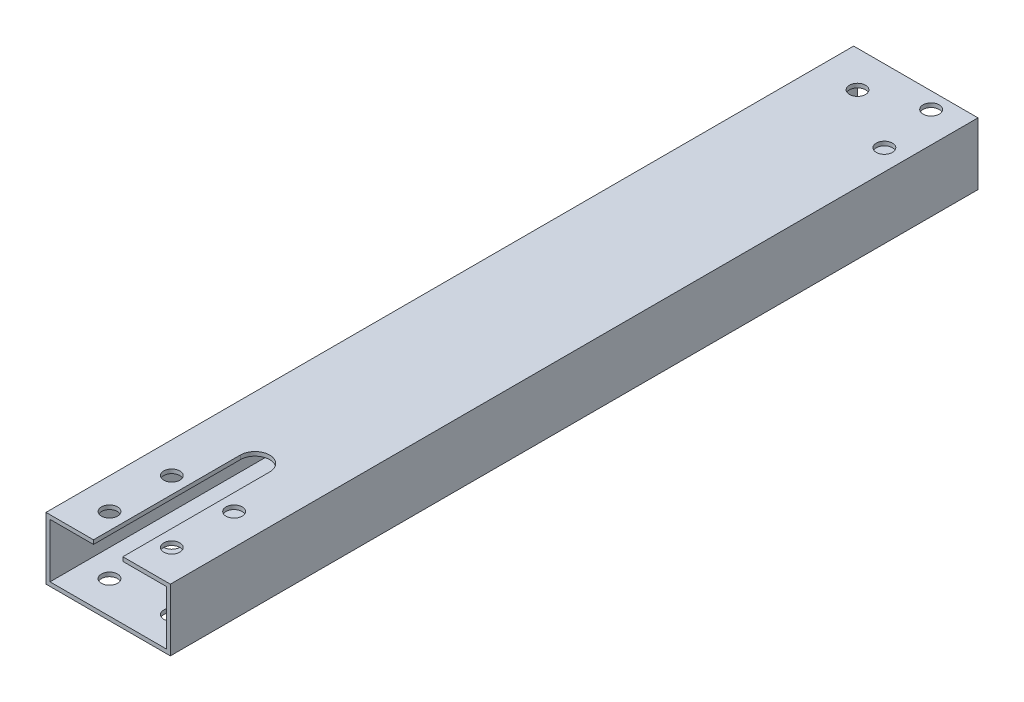
ISO-10303-21;
HEADER;
FILE_DESCRIPTION(('STEP AP214'),'2;1');
FILE_NAME('part.step','',(''),(''),'','','');
FILE_SCHEMA(('AUTOMOTIVE_DESIGN { 1 0 10303 214 1 1 1 1 }'));
ENDSEC;
DATA;
#1=APPLICATION_CONTEXT('core data for automotive mechanical design processes');
#2=APPLICATION_PROTOCOL_DEFINITION('international standard','automotive_design',2000,#1);
#3=PRODUCT_CONTEXT('',#1,'mechanical');
#4=PRODUCT('Part','Part','',(#3));
#5=PRODUCT_RELATED_PRODUCT_CATEGORY('part','',(#4));
#6=PRODUCT_DEFINITION_FORMATION('','',#4);
#7=PRODUCT_DEFINITION_CONTEXT('part definition',#1,'design');
#8=PRODUCT_DEFINITION('design','',#6,#7);
#9=PRODUCT_DEFINITION_SHAPE('','',#8);
#10=(LENGTH_UNIT() NAMED_UNIT(*) SI_UNIT(.MILLI.,.METRE.));
#11=(NAMED_UNIT(*) PLANE_ANGLE_UNIT() SI_UNIT($,.RADIAN.));
#12=(NAMED_UNIT(*) SI_UNIT($,.STERADIAN.) SOLID_ANGLE_UNIT());
#13=UNCERTAINTY_MEASURE_WITH_UNIT(LENGTH_MEASURE(1.E-05),#10,'distance_accuracy_value','');
#14=(GEOMETRIC_REPRESENTATION_CONTEXT(3) GLOBAL_UNCERTAINTY_ASSIGNED_CONTEXT((#13)) GLOBAL_UNIT_ASSIGNED_CONTEXT((#10,
#11,#12)) REPRESENTATION_CONTEXT('',''));
#15=CARTESIAN_POINT('',(0.,0.,0.));
#16=DIRECTION('',(0.,0.,1.));
#17=DIRECTION('',(1.,0.,0.));
#18=AXIS2_PLACEMENT_3D('',#15,#16,#17);
#19=CARTESIAN_POINT('',(0.,0.,330.));
#20=DIRECTION('',(0.,0.,1.));
#21=DIRECTION('',(1.,0.,0.));
#22=AXIS2_PLACEMENT_3D('',#19,#20,#21);
#23=PLANE('',#22);
#24=DIRECTION('',(0.,1.,0.));
#25=VECTOR('',#24,1.);
#26=CARTESIAN_POINT('',(-5.99999999999999,-12.701,330.));
#27=LINE('',#26,#25);
#28=CARTESIAN_POINT('',(-5.99999999999999,11.049,330.));
#29=VERTEX_POINT('',#28);
#30=CARTESIAN_POINT('',(-5.99999999999999,12.7,330.));
#31=VERTEX_POINT('',#30);
#32=EDGE_CURVE('E154',#29,#31,#27,.T.);
#33=ORIENTED_EDGE('',*,*,#32,.T.);
#34=DIRECTION('',(-1.,0.,0.));
#35=VECTOR('',#34,1.);
#36=CARTESIAN_POINT('',(-25.4,12.7,330.));
#37=LINE('',#36,#35);
#38=CARTESIAN_POINT('',(-25.4,12.7,330.));
#39=VERTEX_POINT('',#38);
#40=EDGE_CURVE('E196',#31,#39,#37,.T.);
#41=ORIENTED_EDGE('',*,*,#40,.T.);
#42=DIRECTION('',(0.,-1.,0.));
#43=VECTOR('',#42,1.);
#44=CARTESIAN_POINT('',(-25.4,12.7,330.));
#45=LINE('',#44,#43);
#46=CARTESIAN_POINT('',(-25.4,-12.7,330.));
#47=VERTEX_POINT('',#46);
#48=EDGE_CURVE('E188',#39,#47,#45,.T.);
#49=ORIENTED_EDGE('',*,*,#48,.T.);
#50=DIRECTION('',(1.,0.,0.));
#51=VECTOR('',#50,1.);
#52=CARTESIAN_POINT('',(-25.4,-12.7,330.));
#53=LINE('',#52,#51);
#54=CARTESIAN_POINT('',(25.4,-12.7,330.));
#55=VERTEX_POINT('',#54);
#56=EDGE_CURVE('E191',#47,#55,#53,.T.);
#57=ORIENTED_EDGE('',*,*,#56,.T.);
#58=DIRECTION('',(0.,1.,0.));
#59=VECTOR('',#58,1.);
#60=CARTESIAN_POINT('',(25.4,12.7,330.));
#61=LINE('',#60,#59);
#62=CARTESIAN_POINT('',(25.4,12.7,330.));
#63=VERTEX_POINT('',#62);
#64=EDGE_CURVE('E194',#55,#63,#61,.T.);
#65=ORIENTED_EDGE('',*,*,#64,.T.);
#66=CARTESIAN_POINT('',(6.00000000000001,12.7,330.));
#67=VERTEX_POINT('',#66);
#68=EDGE_CURVE('E153',#63,#67,#37,.T.);
#69=ORIENTED_EDGE('',*,*,#68,.T.);
#70=DIRECTION('',(0.,1.,0.));
#71=VECTOR('',#70,1.);
#72=CARTESIAN_POINT('',(6.00000000000001,-12.701,330.));
#73=LINE('',#72,#71);
#74=CARTESIAN_POINT('',(6.00000000000001,11.049,330.));
#75=VERTEX_POINT('',#74);
#76=EDGE_CURVE('E139',#75,#67,#73,.T.);
#77=ORIENTED_EDGE('',*,*,#76,.F.);
#78=DIRECTION('',(-1.,0.,0.));
#79=VECTOR('',#78,1.);
#80=CARTESIAN_POINT('',(-23.749,11.049,330.));
#81=LINE('',#80,#79);
#82=CARTESIAN_POINT('',(23.749,11.049,330.));
#83=VERTEX_POINT('',#82);
#84=EDGE_CURVE('E151',#83,#75,#81,.T.);
#85=ORIENTED_EDGE('',*,*,#84,.F.);
#86=DIRECTION('',(0.,1.,0.));
#87=VECTOR('',#86,1.);
#88=CARTESIAN_POINT('',(23.749,11.049,330.));
#89=LINE('',#88,#87);
#90=CARTESIAN_POINT('',(23.749,-11.049,330.));
#91=VERTEX_POINT('',#90);
#92=EDGE_CURVE('E163',#91,#83,#89,.T.);
#93=ORIENTED_EDGE('',*,*,#92,.F.);
#94=DIRECTION('',(1.,0.,0.));
#95=VECTOR('',#94,1.);
#96=CARTESIAN_POINT('',(-23.749,-11.049,330.));
#97=LINE('',#96,#95);
#98=CARTESIAN_POINT('',(-23.749,-11.049,330.));
#99=VERTEX_POINT('',#98);
#100=EDGE_CURVE('E303',#99,#91,#97,.T.);
#101=ORIENTED_EDGE('',*,*,#100,.F.);
#102=DIRECTION('',(0.,-1.,0.));
#103=VECTOR('',#102,1.);
#104=CARTESIAN_POINT('',(-23.749,11.049,330.));
#105=LINE('',#104,#103);
#106=CARTESIAN_POINT('',(-23.749,11.049,330.));
#107=VERTEX_POINT('',#106);
#108=EDGE_CURVE('E179',#107,#99,#105,.T.);
#109=ORIENTED_EDGE('',*,*,#108,.F.);
#110=EDGE_CURVE('E159',#29,#107,#81,.T.);
#111=ORIENTED_EDGE('',*,*,#110,.F.);
#112=EDGE_LOOP('',(#33,#41,#49,#57,#65,#69,#77,#85,#93,#101,#109,#111));
#113=FACE_BOUND('',#112,.T.);
#114=ADVANCED_FACE('F43',(#113),#23,.T.);
#115=CARTESIAN_POINT('',(0.,0.,0.));
#116=DIRECTION('',(0.,0.,1.));
#117=DIRECTION('',(1.,0.,0.));
#118=AXIS2_PLACEMENT_3D('',#115,#116,#117);
#119=PLANE('',#118);
#120=DIRECTION('',(0.,-1.,0.));
#121=VECTOR('',#120,1.);
#122=CARTESIAN_POINT('',(-25.4,12.7,0.));
#123=LINE('',#122,#121);
#124=CARTESIAN_POINT('',(-25.4,12.7,0.));
#125=VERTEX_POINT('',#124);
#126=CARTESIAN_POINT('',(-25.4,-12.7,0.));
#127=VERTEX_POINT('',#126);
#128=EDGE_CURVE('E187',#125,#127,#123,.T.);
#129=ORIENTED_EDGE('',*,*,#128,.F.);
#130=DIRECTION('',(-1.,0.,0.));
#131=VECTOR('',#130,1.);
#132=CARTESIAN_POINT('',(-25.4,12.7,0.));
#133=LINE('',#132,#131);
#134=CARTESIAN_POINT('',(25.4,12.7,0.));
#135=VERTEX_POINT('',#134);
#136=EDGE_CURVE('E192',#135,#125,#133,.T.);
#137=ORIENTED_EDGE('',*,*,#136,.F.);
#138=DIRECTION('',(0.,1.,0.));
#139=VECTOR('',#138,1.);
#140=CARTESIAN_POINT('',(25.4,12.7,0.));
#141=LINE('',#140,#139);
#142=CARTESIAN_POINT('',(25.4,-12.7,0.));
#143=VERTEX_POINT('',#142);
#144=EDGE_CURVE('E203',#143,#135,#141,.T.);
#145=ORIENTED_EDGE('',*,*,#144,.F.);
#146=DIRECTION('',(1.,0.,0.));
#147=VECTOR('',#146,1.);
#148=CARTESIAN_POINT('',(-25.4,-12.7,0.));
#149=LINE('',#148,#147);
#150=EDGE_CURVE('E201',#127,#143,#149,.T.);
#151=ORIENTED_EDGE('',*,*,#150,.F.);
#152=EDGE_LOOP('',(#129,#137,#145,#151));
#153=FACE_BOUND('',#152,.T.);
#154=DIRECTION('',(0.,-1.,0.));
#155=VECTOR('',#154,1.);
#156=CARTESIAN_POINT('',(-23.749,11.049,0.));
#157=LINE('',#156,#155);
#158=CARTESIAN_POINT('',(-23.749,11.049,0.));
#159=VERTEX_POINT('',#158);
#160=CARTESIAN_POINT('',(-23.749,-11.049,0.));
#161=VERTEX_POINT('',#160);
#162=EDGE_CURVE('E167',#159,#161,#157,.T.);
#163=ORIENTED_EDGE('',*,*,#162,.T.);
#164=DIRECTION('',(1.,0.,0.));
#165=VECTOR('',#164,1.);
#166=CARTESIAN_POINT('',(-23.749,-11.049,0.));
#167=LINE('',#166,#165);
#168=CARTESIAN_POINT('',(23.749,-11.049,0.));
#169=VERTEX_POINT('',#168);
#170=EDGE_CURVE('E170',#161,#169,#167,.T.);
#171=ORIENTED_EDGE('',*,*,#170,.T.);
#172=DIRECTION('',(0.,1.,0.));
#173=VECTOR('',#172,1.);
#174=CARTESIAN_POINT('',(23.749,11.049,0.));
#175=LINE('',#174,#173);
#176=CARTESIAN_POINT('',(23.749,11.049,0.));
#177=VERTEX_POINT('',#176);
#178=EDGE_CURVE('E174',#169,#177,#175,.T.);
#179=ORIENTED_EDGE('',*,*,#178,.T.);
#180=DIRECTION('',(-1.,0.,0.));
#181=VECTOR('',#180,1.);
#182=CARTESIAN_POINT('',(-23.749,11.049,0.));
#183=LINE('',#182,#181);
#184=EDGE_CURVE('E177',#177,#159,#183,.T.);
#185=ORIENTED_EDGE('',*,*,#184,.T.);
#186=EDGE_LOOP('',(#163,#171,#179,#185));
#187=FACE_BOUND('',#186,.T.);
#188=ADVANCED_FACE('F318',(#153,#187),#119,.F.);
#189=CARTESIAN_POINT('',(-25.4,12.7,330.));
#190=DIRECTION('',(1.,0.,0.));
#191=DIRECTION('',(0.,0.,-1.));
#192=AXIS2_PLACEMENT_3D('',#189,#190,#191);
#193=PLANE('',#192);
#194=ORIENTED_EDGE('',*,*,#128,.T.);
#195=DIRECTION('',(0.,0.,-1.));
#196=VECTOR('',#195,1.);
#197=CARTESIAN_POINT('',(-25.4,-12.7,330.));
#198=LINE('',#197,#196);
#199=EDGE_CURVE('E11',#47,#127,#198,.T.);
#200=ORIENTED_EDGE('',*,*,#199,.F.);
#201=ORIENTED_EDGE('',*,*,#48,.F.);
#202=DIRECTION('',(0.,0.,-1.));
#203=VECTOR('',#202,1.);
#204=CARTESIAN_POINT('',(-25.4,12.7,330.));
#205=LINE('',#204,#203);
#206=EDGE_CURVE('E198',#39,#125,#205,.T.);
#207=ORIENTED_EDGE('',*,*,#206,.T.);
#208=EDGE_LOOP('',(#194,#200,#201,#207));
#209=FACE_BOUND('',#208,.T.);
#210=ADVANCED_FACE('F45',(#209),#193,.F.);
#211=CARTESIAN_POINT('',(-25.4,-12.7,330.));
#212=DIRECTION('',(0.,1.,0.));
#213=DIRECTION('',(-1.,0.,0.));
#214=AXIS2_PLACEMENT_3D('',#211,#212,#213);
#215=PLANE('',#214);
#216=CARTESIAN_POINT('',(-9.13093229857634,-12.7,14.7045730934256));
#217=DIRECTION('',(0.,1.,0.));
#218=DIRECTION('',(0.,0.,1.));
#219=AXIS2_PLACEMENT_3D('',#216,#217,#218);
#220=CIRCLE('',#219,3.30000000399998);
#221=CARTESIAN_POINT('',(-9.13093229857634,-12.7,18.0045730974256));
#222=VERTEX_POINT('',#221);
#223=EDGE_CURVE('E379',#222,#222,#220,.T.);
#224=ORIENTED_EDGE('',*,*,#223,.T.);
#225=EDGE_LOOP('',(#224));
#226=FACE_BOUND('',#225,.T.);
#227=CARTESIAN_POINT('',(12.8594487581903,-12.7,6.61611582530578));
#228=DIRECTION('',(0.,1.,0.));
#229=DIRECTION('',(0.,0.,1.));
#230=AXIS2_PLACEMENT_3D('',#227,#228,#229);
#231=CIRCLE('',#230,3.30000000399999);
#232=CARTESIAN_POINT('',(12.8594487581903,-12.7,9.91611582930576));
#233=VERTEX_POINT('',#232);
#234=EDGE_CURVE('E237',#233,#233,#231,.T.);
#235=ORIENTED_EDGE('',*,*,#234,.T.);
#236=EDGE_LOOP('',(#235));
#237=FACE_BOUND('',#236,.T.);
#238=CARTESIAN_POINT('',(16.8498298149568,-12.7,29.7045730934257));
#239=DIRECTION('',(0.,1.,0.));
#240=DIRECTION('',(0.,0.,1.));
#241=AXIS2_PLACEMENT_3D('',#238,#239,#240);
#242=CIRCLE('',#241,3.30000000399999);
#243=CARTESIAN_POINT('',(16.8498298149568,-12.7,33.0045730974257));
#244=VERTEX_POINT('',#243);
#245=EDGE_CURVE('E233',#244,#244,#242,.T.);
#246=ORIENTED_EDGE('',*,*,#245,.T.);
#247=EDGE_LOOP('',(#246));
#248=FACE_BOUND('',#247,.T.);
#249=CARTESIAN_POINT('',(12.7279220613578,-12.7,316.727922061358));
#250=DIRECTION('',(0.,1.,0.));
#251=DIRECTION('',(0.,0.,1.));
#252=AXIS2_PLACEMENT_3D('',#249,#250,#251);
#253=CIRCLE('',#252,3.30000000000001);
#254=CARTESIAN_POINT('',(12.7279220613578,-12.7,320.027922061358));
#255=VERTEX_POINT('',#254);
#256=EDGE_CURVE('E262',#255,#255,#253,.T.);
#257=ORIENTED_EDGE('',*,*,#256,.T.);
#258=EDGE_LOOP('',(#257));
#259=FACE_BOUND('',#258,.T.);
#260=CARTESIAN_POINT('',(12.7279220613579,-12.7,291.272077938642));
#261=DIRECTION('',(0.,1.,0.));
#262=DIRECTION('',(0.,0.,1.));
#263=AXIS2_PLACEMENT_3D('',#260,#261,#262);
#264=CIRCLE('',#263,3.30000000000001);
#265=CARTESIAN_POINT('',(12.7279220613579,-12.7,294.572077938642));
#266=VERTEX_POINT('',#265);
#267=EDGE_CURVE('E273',#266,#266,#264,.T.);
#268=ORIENTED_EDGE('',*,*,#267,.T.);
#269=EDGE_LOOP('',(#268));
#270=FACE_BOUND('',#269,.T.);
#271=CARTESIAN_POINT('',(-12.7279220613578,-12.7,291.272077938642));
#272=DIRECTION('',(0.,1.,0.));
#273=DIRECTION('',(0.,0.,1.));
#274=AXIS2_PLACEMENT_3D('',#271,#272,#273);
#275=CIRCLE('',#274,3.30000000000001);
#276=CARTESIAN_POINT('',(-12.7279220613578,-12.7,294.572077938642));
#277=VERTEX_POINT('',#276);
#278=EDGE_CURVE('E267',#277,#277,#275,.T.);
#279=ORIENTED_EDGE('',*,*,#278,.T.);
#280=EDGE_LOOP('',(#279));
#281=FACE_BOUND('',#280,.T.);
#282=CARTESIAN_POINT('',(-12.7279220613579,-12.7,316.727922061358));
#283=DIRECTION('',(0.,1.,0.));
#284=DIRECTION('',(0.,0.,1.));
#285=AXIS2_PLACEMENT_3D('',#282,#283,#284);
#286=CIRCLE('',#285,3.29999999999996);
#287=CARTESIAN_POINT('',(-12.7279220613579,-12.7,320.027922061358));
#288=VERTEX_POINT('',#287);
#289=EDGE_CURVE('E217',#288,#288,#286,.T.);
#290=ORIENTED_EDGE('',*,*,#289,.T.);
#291=EDGE_LOOP('',(#290));
#292=FACE_BOUND('',#291,.T.);
#293=ORIENTED_EDGE('',*,*,#150,.T.);
#294=DIRECTION('',(0.,0.,-1.));
#295=VECTOR('',#294,1.);
#296=CARTESIAN_POINT('',(25.4,-12.7,330.));
#297=LINE('',#296,#295);
#298=EDGE_CURVE('E52',#55,#143,#297,.T.);
#299=ORIENTED_EDGE('',*,*,#298,.F.);
#300=ORIENTED_EDGE('',*,*,#56,.F.);
#301=ORIENTED_EDGE('',*,*,#199,.T.);
#302=EDGE_LOOP('',(#293,#299,#300,#301));
#303=FACE_BOUND('',#302,.T.);
#304=ADVANCED_FACE('F336',(#226,#237,#248,#259,#270,#281,#292,#303),#215,.F.);
#305=CARTESIAN_POINT('',(25.4,12.7,330.));
#306=DIRECTION('',(-1.,0.,0.));
#307=DIRECTION('',(0.,0.,1.));
#308=AXIS2_PLACEMENT_3D('',#305,#306,#307);
#309=PLANE('',#308);
#310=ORIENTED_EDGE('',*,*,#144,.T.);
#311=DIRECTION('',(0.,0.,-1.));
#312=VECTOR('',#311,1.);
#313=CARTESIAN_POINT('',(25.4,12.7,330.));
#314=LINE('',#313,#312);
#315=EDGE_CURVE('E208',#63,#135,#314,.T.);
#316=ORIENTED_EDGE('',*,*,#315,.F.);
#317=ORIENTED_EDGE('',*,*,#64,.F.);
#318=ORIENTED_EDGE('',*,*,#298,.T.);
#319=EDGE_LOOP('',(#310,#316,#317,#318));
#320=FACE_BOUND('',#319,.T.);
#321=ADVANCED_FACE('F339',(#320),#309,.F.);
#322=CARTESIAN_POINT('',(-25.4,12.7,330.));
#323=DIRECTION('',(0.,-1.,0.));
#324=DIRECTION('',(1.,0.,0.));
#325=AXIS2_PLACEMENT_3D('',#322,#323,#324);
#326=PLANE('',#325);
#327=CARTESIAN_POINT('',(-9.13093229857634,12.7,14.7045730934256));
#328=DIRECTION('',(0.,-1.,0.));
#329=DIRECTION('',(1.,0.,0.));
#330=AXIS2_PLACEMENT_3D('',#327,#328,#329);
#331=CIRCLE('',#330,3.30000000399999);
#332=CARTESIAN_POINT('',(-5.83093229457635,12.7,14.7045730934256));
#333=VERTEX_POINT('',#332);
#334=EDGE_CURVE('E244',#333,#333,#331,.T.);
#335=ORIENTED_EDGE('',*,*,#334,.T.);
#336=EDGE_LOOP('',(#335));
#337=FACE_BOUND('',#336,.T.);
#338=CARTESIAN_POINT('',(12.8594487581903,12.7,6.61611582530578));
#339=DIRECTION('',(0.,-1.,0.));
#340=DIRECTION('',(1.,0.,0.));
#341=AXIS2_PLACEMENT_3D('',#338,#339,#340);
#342=CIRCLE('',#341,3.30000000399999);
#343=CARTESIAN_POINT('',(16.1594487621902,12.7,6.61611582530578));
#344=VERTEX_POINT('',#343);
#345=EDGE_CURVE('E241',#344,#344,#342,.T.);
#346=ORIENTED_EDGE('',*,*,#345,.T.);
#347=EDGE_LOOP('',(#346));
#348=FACE_BOUND('',#347,.T.);
#349=CARTESIAN_POINT('',(16.8498298149568,12.7,29.7045730934257));
#350=DIRECTION('',(0.,-1.,0.));
#351=DIRECTION('',(1.,0.,0.));
#352=AXIS2_PLACEMENT_3D('',#349,#350,#351);
#353=CIRCLE('',#352,3.30000000399999);
#354=CARTESIAN_POINT('',(20.1498298189567,12.7,29.7045730934257));
#355=VERTEX_POINT('',#354);
#356=EDGE_CURVE('E259',#355,#355,#353,.T.);
#357=ORIENTED_EDGE('',*,*,#356,.T.);
#358=EDGE_LOOP('',(#357));
#359=FACE_BOUND('',#358,.T.);
#360=CARTESIAN_POINT('',(12.7279220613578,12.7,316.727922061358));
#361=DIRECTION('',(0.,1.,0.));
#362=DIRECTION('',(0.,0.,1.));
#363=AXIS2_PLACEMENT_3D('',#360,#361,#362);
#364=CIRCLE('',#363,3.30000000000001);
#365=CARTESIAN_POINT('',(12.7279220613578,12.7,320.027922061358));
#366=VERTEX_POINT('',#365);
#367=EDGE_CURVE('E276',#366,#366,#364,.T.);
#368=ORIENTED_EDGE('',*,*,#367,.F.);
#369=EDGE_LOOP('',(#368));
#370=FACE_BOUND('',#369,.T.);
#371=CARTESIAN_POINT('',(12.7279220613579,12.7,291.272077938642));
#372=DIRECTION('',(0.,1.,0.));
#373=DIRECTION('',(0.,0.,1.));
#374=AXIS2_PLACEMENT_3D('',#371,#372,#373);
#375=CIRCLE('',#374,3.30000000000001);
#376=CARTESIAN_POINT('',(12.7279220613579,12.7,294.572077938642));
#377=VERTEX_POINT('',#376);
#378=EDGE_CURVE('E270',#377,#377,#375,.T.);
#379=ORIENTED_EDGE('',*,*,#378,.F.);
#380=EDGE_LOOP('',(#379));
#381=FACE_BOUND('',#380,.T.);
#382=CARTESIAN_POINT('',(-12.7279220613578,12.7,291.272077938642));
#383=DIRECTION('',(0.,1.,0.));
#384=DIRECTION('',(0.,0.,1.));
#385=AXIS2_PLACEMENT_3D('',#382,#383,#384);
#386=CIRCLE('',#385,3.30000000000001);
#387=CARTESIAN_POINT('',(-12.7279220613578,12.7,294.572077938642));
#388=VERTEX_POINT('',#387);
#389=EDGE_CURVE('E263',#388,#388,#386,.T.);
#390=ORIENTED_EDGE('',*,*,#389,.F.);
#391=EDGE_LOOP('',(#390));
#392=FACE_BOUND('',#391,.T.);
#393=CARTESIAN_POINT('',(-12.7279220613579,12.7,316.727922061358));
#394=DIRECTION('',(0.,1.,0.));
#395=DIRECTION('',(0.,0.,1.));
#396=AXIS2_PLACEMENT_3D('',#393,#394,#395);
#397=CIRCLE('',#396,3.29999999999996);
#398=CARTESIAN_POINT('',(-12.7279220613579,12.7,320.027922061358));
#399=VERTEX_POINT('',#398);
#400=EDGE_CURVE('E266',#399,#399,#397,.T.);
#401=ORIENTED_EDGE('',*,*,#400,.F.);
#402=EDGE_LOOP('',(#401));
#403=FACE_BOUND('',#402,.T.);
#404=ORIENTED_EDGE('',*,*,#40,.F.);
#405=DIRECTION('',(0.,0.,1.));
#406=VECTOR('',#405,1.);
#407=CARTESIAN_POINT('',(-6.,12.7,270.));
#408=LINE('',#407,#406);
#409=CARTESIAN_POINT('',(-6.,12.7,270.));
#410=VERTEX_POINT('',#409);
#411=EDGE_CURVE('E295',#410,#31,#408,.T.);
#412=ORIENTED_EDGE('',*,*,#411,.F.);
#413=CARTESIAN_POINT('',(0.,12.7,270.));
#414=DIRECTION('',(0.,1.,0.));
#415=DIRECTION('',(0.,0.,1.));
#416=AXIS2_PLACEMENT_3D('',#413,#414,#415);
#417=CIRCLE('',#416,6.);
#418=CARTESIAN_POINT('',(6.,12.7,270.));
#419=VERTEX_POINT('',#418);
#420=EDGE_CURVE('E143',#419,#410,#417,.T.);
#421=ORIENTED_EDGE('',*,*,#420,.F.);
#422=DIRECTION('',(0.,0.,-1.));
#423=VECTOR('',#422,1.);
#424=CARTESIAN_POINT('',(6.,12.7,270.));
#425=LINE('',#424,#423);
#426=EDGE_CURVE('E297',#67,#419,#425,.T.);
#427=ORIENTED_EDGE('',*,*,#426,.F.);
#428=ORIENTED_EDGE('',*,*,#68,.F.);
#429=ORIENTED_EDGE('',*,*,#315,.T.);
#430=ORIENTED_EDGE('',*,*,#136,.T.);
#431=ORIENTED_EDGE('',*,*,#206,.F.);
#432=EDGE_LOOP('',(#404,#412,#421,#427,#428,#429,#430,#431));
#433=FACE_BOUND('',#432,.T.);
#434=ADVANCED_FACE('F325',(#337,#348,#359,#370,#381,#392,#403,#433),#326,.F.);
#435=CARTESIAN_POINT('',(-23.749,11.049,330.));
#436=DIRECTION('',(1.,0.,0.));
#437=DIRECTION('',(0.,1.,0.));
#438=AXIS2_PLACEMENT_3D('',#435,#436,#437);
#439=PLANE('',#438);
#440=ORIENTED_EDGE('',*,*,#162,.F.);
#441=DIRECTION('',(0.,0.,-1.));
#442=VECTOR('',#441,1.);
#443=CARTESIAN_POINT('',(-23.749,11.049,330.));
#444=LINE('',#443,#442);
#445=EDGE_CURVE('E158',#107,#159,#444,.T.);
#446=ORIENTED_EDGE('',*,*,#445,.F.);
#447=ORIENTED_EDGE('',*,*,#108,.T.);
#448=DIRECTION('',(0.,0.,-1.));
#449=VECTOR('',#448,1.);
#450=CARTESIAN_POINT('',(-23.749,-11.049,330.));
#451=LINE('',#450,#449);
#452=EDGE_CURVE('E184',#99,#161,#451,.T.);
#453=ORIENTED_EDGE('',*,*,#452,.T.);
#454=EDGE_LOOP('',(#440,#446,#447,#453));
#455=FACE_BOUND('',#454,.T.);
#456=ADVANCED_FACE('F315',(#455),#439,.T.);
#457=CARTESIAN_POINT('',(-23.749,-11.049,330.));
#458=DIRECTION('',(0.,1.,0.));
#459=DIRECTION('',(0.,0.,1.));
#460=AXIS2_PLACEMENT_3D('',#457,#458,#459);
#461=PLANE('',#460);
#462=CARTESIAN_POINT('',(-9.13093229857634,-11.049,14.7045730934256));
#463=DIRECTION('',(0.,1.,0.));
#464=DIRECTION('',(0.,0.,1.));
#465=AXIS2_PLACEMENT_3D('',#462,#463,#464);
#466=CIRCLE('',#465,3.30000000399999);
#467=CARTESIAN_POINT('',(-9.13093229857634,-11.049,18.0045730974256));
#468=VERTEX_POINT('',#467);
#469=EDGE_CURVE('E249',#468,#468,#466,.T.);
#470=ORIENTED_EDGE('',*,*,#469,.F.);
#471=EDGE_LOOP('',(#470));
#472=FACE_BOUND('',#471,.T.);
#473=CARTESIAN_POINT('',(12.8594487581903,-11.049,6.61611582530578));
#474=DIRECTION('',(0.,1.,0.));
#475=DIRECTION('',(0.,0.,1.));
#476=AXIS2_PLACEMENT_3D('',#473,#474,#475);
#477=CIRCLE('',#476,3.30000000399999);
#478=CARTESIAN_POINT('',(12.8594487581903,-11.049,9.91611582930577));
#479=VERTEX_POINT('',#478);
#480=EDGE_CURVE('E236',#479,#479,#477,.T.);
#481=ORIENTED_EDGE('',*,*,#480,.F.);
#482=EDGE_LOOP('',(#481));
#483=FACE_BOUND('',#482,.T.);
#484=CARTESIAN_POINT('',(16.8498298149568,-11.049,29.7045730934257));
#485=DIRECTION('',(0.,1.,0.));
#486=DIRECTION('',(0.,0.,1.));
#487=AXIS2_PLACEMENT_3D('',#484,#485,#486);
#488=CIRCLE('',#487,3.30000000399999);
#489=CARTESIAN_POINT('',(16.8498298149568,-11.049,33.0045730974257));
#490=VERTEX_POINT('',#489);
#491=EDGE_CURVE('E230',#490,#490,#488,.T.);
#492=ORIENTED_EDGE('',*,*,#491,.F.);
#493=EDGE_LOOP('',(#492));
#494=FACE_BOUND('',#493,.T.);
#495=CARTESIAN_POINT('',(12.7279220613578,-11.049,316.727922061358));
#496=DIRECTION('',(0.,1.,0.));
#497=DIRECTION('',(0.,0.,1.));
#498=AXIS2_PLACEMENT_3D('',#495,#496,#497);
#499=CIRCLE('',#498,3.30000000000001);
#500=CARTESIAN_POINT('',(12.7279220613578,-11.049,320.027922061358));
#501=VERTEX_POINT('',#500);
#502=EDGE_CURVE('E229',#501,#501,#499,.T.);
#503=ORIENTED_EDGE('',*,*,#502,.F.);
#504=EDGE_LOOP('',(#503));
#505=FACE_BOUND('',#504,.T.);
#506=CARTESIAN_POINT('',(12.7279220613579,-11.049,291.272077938642));
#507=DIRECTION('',(0.,1.,0.));
#508=DIRECTION('',(0.,0.,1.));
#509=AXIS2_PLACEMENT_3D('',#506,#507,#508);
#510=CIRCLE('',#509,3.30000000000001);
#511=CARTESIAN_POINT('',(12.7279220613579,-11.049,294.572077938642));
#512=VERTEX_POINT('',#511);
#513=EDGE_CURVE('E225',#512,#512,#510,.T.);
#514=ORIENTED_EDGE('',*,*,#513,.F.);
#515=EDGE_LOOP('',(#514));
#516=FACE_BOUND('',#515,.T.);
#517=CARTESIAN_POINT('',(-12.7279220613578,-11.049,291.272077938642));
#518=DIRECTION('',(0.,1.,0.));
#519=DIRECTION('',(0.,0.,1.));
#520=AXIS2_PLACEMENT_3D('',#517,#518,#519);
#521=CIRCLE('',#520,3.30000000000001);
#522=CARTESIAN_POINT('',(-12.7279220613578,-11.049,294.572077938642));
#523=VERTEX_POINT('',#522);
#524=EDGE_CURVE('E221',#523,#523,#521,.T.);
#525=ORIENTED_EDGE('',*,*,#524,.F.);
#526=EDGE_LOOP('',(#525));
#527=FACE_BOUND('',#526,.T.);
#528=CARTESIAN_POINT('',(-12.7279220613579,-11.049,316.727922061358));
#529=DIRECTION('',(0.,1.,0.));
#530=DIRECTION('',(0.,0.,1.));
#531=AXIS2_PLACEMENT_3D('',#528,#529,#530);
#532=CIRCLE('',#531,3.29999999999996);
#533=CARTESIAN_POINT('',(-12.7279220613579,-11.049,320.027922061358));
#534=VERTEX_POINT('',#533);
#535=EDGE_CURVE('E216',#534,#534,#532,.T.);
#536=ORIENTED_EDGE('',*,*,#535,.F.);
#537=EDGE_LOOP('',(#536));
#538=FACE_BOUND('',#537,.T.);
#539=ORIENTED_EDGE('',*,*,#170,.F.);
#540=ORIENTED_EDGE('',*,*,#452,.F.);
#541=ORIENTED_EDGE('',*,*,#100,.T.);
#542=DIRECTION('',(0.,0.,-1.));
#543=VECTOR('',#542,1.);
#544=CARTESIAN_POINT('',(23.749,-11.049,330.));
#545=LINE('',#544,#543);
#546=EDGE_CURVE('E182',#91,#169,#545,.T.);
#547=ORIENTED_EDGE('',*,*,#546,.T.);
#548=EDGE_LOOP('',(#539,#540,#541,#547));
#549=FACE_BOUND('',#548,.T.);
#550=ADVANCED_FACE('F316',(#472,#483,#494,#505,#516,#527,#538,#549),#461,.T.);
#551=CARTESIAN_POINT('',(23.749,11.049,330.));
#552=DIRECTION('',(-1.,0.,0.));
#553=DIRECTION('',(0.,0.,1.));
#554=AXIS2_PLACEMENT_3D('',#551,#552,#553);
#555=PLANE('',#554);
#556=ORIENTED_EDGE('',*,*,#178,.F.);
#557=ORIENTED_EDGE('',*,*,#546,.F.);
#558=ORIENTED_EDGE('',*,*,#92,.T.);
#559=DIRECTION('',(0.,0.,-1.));
#560=VECTOR('',#559,1.);
#561=CARTESIAN_POINT('',(23.749,11.049,330.));
#562=LINE('',#561,#560);
#563=EDGE_CURVE('E68',#83,#177,#562,.T.);
#564=ORIENTED_EDGE('',*,*,#563,.T.);
#565=EDGE_LOOP('',(#556,#557,#558,#564));
#566=FACE_BOUND('',#565,.T.);
#567=ADVANCED_FACE('F310',(#566),#555,.T.);
#568=CARTESIAN_POINT('',(-23.749,11.049,330.));
#569=DIRECTION('',(0.,-1.,0.));
#570=DIRECTION('',(0.,0.,-1.));
#571=AXIS2_PLACEMENT_3D('',#568,#569,#570);
#572=PLANE('',#571);
#573=CARTESIAN_POINT('',(-9.13093229857634,11.049,14.7045730934256));
#574=DIRECTION('',(0.,-1.,0.));
#575=DIRECTION('',(0.,0.,-1.));
#576=AXIS2_PLACEMENT_3D('',#573,#574,#575);
#577=CIRCLE('',#576,3.30000000399999);
#578=CARTESIAN_POINT('',(-9.13093229857634,11.049,11.4045730894256));
#579=VERTEX_POINT('',#578);
#580=EDGE_CURVE('E47',#579,#579,#577,.T.);
#581=ORIENTED_EDGE('',*,*,#580,.F.);
#582=EDGE_LOOP('',(#581));
#583=FACE_BOUND('',#582,.T.);
#584=CARTESIAN_POINT('',(12.8594487581903,11.049,6.61611582530578));
#585=DIRECTION('',(0.,-1.,0.));
#586=DIRECTION('',(0.,0.,-1.));
#587=AXIS2_PLACEMENT_3D('',#584,#585,#586);
#588=CIRCLE('',#587,3.30000000399999);
#589=CARTESIAN_POINT('',(12.8594487581903,11.049,3.31611582130579));
#590=VERTEX_POINT('',#589);
#591=EDGE_CURVE('E234',#590,#590,#588,.T.);
#592=ORIENTED_EDGE('',*,*,#591,.F.);
#593=EDGE_LOOP('',(#592));
#594=FACE_BOUND('',#593,.T.);
#595=CARTESIAN_POINT('',(16.8498298149568,11.049,29.7045730934257));
#596=DIRECTION('',(0.,-1.,0.));
#597=DIRECTION('',(0.,0.,-1.));
#598=AXIS2_PLACEMENT_3D('',#595,#596,#597);
#599=CIRCLE('',#598,3.30000000399999);
#600=CARTESIAN_POINT('',(16.8498298149568,11.049,26.4045730894257));
#601=VERTEX_POINT('',#600);
#602=EDGE_CURVE('E232',#601,#601,#599,.T.);
#603=ORIENTED_EDGE('',*,*,#602,.F.);
#604=EDGE_LOOP('',(#603));
#605=FACE_BOUND('',#604,.T.);
#606=CARTESIAN_POINT('',(12.7279220613578,11.049,316.727922061358));
#607=DIRECTION('',(0.,-1.,0.));
#608=DIRECTION('',(0.,0.,-1.));
#609=AXIS2_PLACEMENT_3D('',#606,#607,#608);
#610=CIRCLE('',#609,3.30000000000001);
#611=CARTESIAN_POINT('',(12.7279220613578,11.049,313.427922061358));
#612=VERTEX_POINT('',#611);
#613=EDGE_CURVE('E226',#612,#612,#610,.T.);
#614=ORIENTED_EDGE('',*,*,#613,.F.);
#615=EDGE_LOOP('',(#614));
#616=FACE_BOUND('',#615,.T.);
#617=CARTESIAN_POINT('',(12.7279220613579,11.049,291.272077938642));
#618=DIRECTION('',(0.,-1.,0.));
#619=DIRECTION('',(0.,0.,-1.));
#620=AXIS2_PLACEMENT_3D('',#617,#618,#619);
#621=CIRCLE('',#620,3.30000000000001);
#622=CARTESIAN_POINT('',(12.7279220613579,11.049,287.972077938642));
#623=VERTEX_POINT('',#622);
#624=EDGE_CURVE('E222',#623,#623,#621,.T.);
#625=ORIENTED_EDGE('',*,*,#624,.F.);
#626=EDGE_LOOP('',(#625));
#627=FACE_BOUND('',#626,.T.);
#628=CARTESIAN_POINT('',(-12.7279220613578,11.049,291.272077938642));
#629=DIRECTION('',(0.,-1.,0.));
#630=DIRECTION('',(0.,0.,-1.));
#631=AXIS2_PLACEMENT_3D('',#628,#629,#630);
#632=CIRCLE('',#631,3.30000000000001);
#633=CARTESIAN_POINT('',(-12.7279220613578,11.049,287.972077938642));
#634=VERTEX_POINT('',#633);
#635=EDGE_CURVE('E218',#634,#634,#632,.T.);
#636=ORIENTED_EDGE('',*,*,#635,.F.);
#637=EDGE_LOOP('',(#636));
#638=FACE_BOUND('',#637,.T.);
#639=CARTESIAN_POINT('',(-12.7279220613579,11.049,316.727922061358));
#640=DIRECTION('',(0.,-1.,0.));
#641=DIRECTION('',(0.,0.,-1.));
#642=AXIS2_PLACEMENT_3D('',#639,#640,#641);
#643=CIRCLE('',#642,3.29999999999996);
#644=CARTESIAN_POINT('',(-12.7279220613579,11.049,313.427922061358));
#645=VERTEX_POINT('',#644);
#646=EDGE_CURVE('E213',#645,#645,#643,.T.);
#647=ORIENTED_EDGE('',*,*,#646,.F.);
#648=EDGE_LOOP('',(#647));
#649=FACE_BOUND('',#648,.T.);
#650=DIRECTION('',(0.,0.,1.));
#651=VECTOR('',#650,1.);
#652=CARTESIAN_POINT('',(-6.,11.049,270.));
#653=LINE('',#652,#651);
#654=CARTESIAN_POINT('',(-6.,11.049,270.));
#655=VERTEX_POINT('',#654);
#656=EDGE_CURVE('E171',#655,#29,#653,.T.);
#657=ORIENTED_EDGE('',*,*,#656,.T.);
#658=ORIENTED_EDGE('',*,*,#110,.T.);
#659=ORIENTED_EDGE('',*,*,#445,.T.);
#660=ORIENTED_EDGE('',*,*,#184,.F.);
#661=ORIENTED_EDGE('',*,*,#563,.F.);
#662=ORIENTED_EDGE('',*,*,#84,.T.);
#663=DIRECTION('',(0.,0.,-1.));
#664=VECTOR('',#663,1.);
#665=CARTESIAN_POINT('',(6.,11.049,270.));
#666=LINE('',#665,#664);
#667=CARTESIAN_POINT('',(6.,11.049,270.));
#668=VERTEX_POINT('',#667);
#669=EDGE_CURVE('E135',#75,#668,#666,.T.);
#670=ORIENTED_EDGE('',*,*,#669,.T.);
#671=CARTESIAN_POINT('',(0.,11.049,270.));
#672=DIRECTION('',(0.,-1.,0.));
#673=DIRECTION('',(0.,0.,-1.));
#674=AXIS2_PLACEMENT_3D('',#671,#672,#673);
#675=CIRCLE('',#674,6.);
#676=EDGE_CURVE('E144',#668,#655,#675,.F.);
#677=ORIENTED_EDGE('',*,*,#676,.T.);
#678=EDGE_LOOP('',(#657,#658,#659,#660,#661,#662,#670,#677));
#679=FACE_BOUND('',#678,.T.);
#680=ADVANCED_FACE('F157',(#583,#594,#605,#616,#627,#638,#649,#679),#572,.T.);
#681=CARTESIAN_POINT('',(-6.,-12.701,270.));
#682=DIRECTION('',(-1.,0.,0.));
#683=DIRECTION('',(0.,0.,1.));
#684=AXIS2_PLACEMENT_3D('',#681,#682,#683);
#685=PLANE('',#684);
#686=DIRECTION('',(0.,1.,0.));
#687=VECTOR('',#686,1.);
#688=CARTESIAN_POINT('',(-6.,-12.701,270.));
#689=LINE('',#688,#687);
#690=EDGE_CURVE('E60',#655,#410,#689,.T.);
#691=ORIENTED_EDGE('',*,*,#690,.T.);
#692=ORIENTED_EDGE('',*,*,#411,.T.);
#693=ORIENTED_EDGE('',*,*,#32,.F.);
#694=ORIENTED_EDGE('',*,*,#656,.F.);
#695=EDGE_LOOP('',(#691,#692,#693,#694));
#696=FACE_BOUND('',#695,.T.);
#697=ADVANCED_FACE('F320',(#696),#685,.F.);
#698=CARTESIAN_POINT('',(6.,-12.701,270.));
#699=DIRECTION('',(1.,0.,0.));
#700=DIRECTION('',(0.,0.,-1.));
#701=AXIS2_PLACEMENT_3D('',#698,#699,#700);
#702=PLANE('',#701);
#703=ORIENTED_EDGE('',*,*,#76,.T.);
#704=ORIENTED_EDGE('',*,*,#426,.T.);
#705=DIRECTION('',(0.,1.,0.));
#706=VECTOR('',#705,1.);
#707=CARTESIAN_POINT('',(6.,-12.701,270.));
#708=LINE('',#707,#706);
#709=EDGE_CURVE('E141',#668,#419,#708,.T.);
#710=ORIENTED_EDGE('',*,*,#709,.F.);
#711=ORIENTED_EDGE('',*,*,#669,.F.);
#712=EDGE_LOOP('',(#703,#704,#710,#711));
#713=FACE_BOUND('',#712,.T.);
#714=ADVANCED_FACE('F137',(#713),#702,.F.);
#715=CARTESIAN_POINT('',(0.,-12.701,270.));
#716=DIRECTION('',(0.,1.,0.));
#717=DIRECTION('',(0.,0.,1.));
#718=AXIS2_PLACEMENT_3D('',#715,#716,#717);
#719=CYLINDRICAL_SURFACE('',#718,6.);
#720=ORIENTED_EDGE('',*,*,#709,.T.);
#721=ORIENTED_EDGE('',*,*,#420,.T.);
#722=ORIENTED_EDGE('',*,*,#690,.F.);
#723=ORIENTED_EDGE('',*,*,#676,.F.);
#724=EDGE_LOOP('',(#720,#721,#722,#723));
#725=FACE_BOUND('',#724,.T.);
#726=ADVANCED_FACE('F340',(#725),#719,.F.);
#727=CARTESIAN_POINT('',(-12.7279220613579,-12.7,316.727922061358));
#728=DIRECTION('',(0.,1.,0.));
#729=DIRECTION('',(0.,0.,1.));
#730=AXIS2_PLACEMENT_3D('',#727,#728,#729);
#731=CYLINDRICAL_SURFACE('',#730,3.29999999999996);
#732=ORIENTED_EDGE('',*,*,#646,.T.);
#733=EDGE_LOOP('',(#732));
#734=FACE_BOUND('',#733,.T.);
#735=ORIENTED_EDGE('',*,*,#400,.T.);
#736=EDGE_LOOP('',(#735));
#737=FACE_BOUND('',#736,.T.);
#738=ADVANCED_FACE('F342',(#734,#737),#731,.F.);
#739=CARTESIAN_POINT('',(-12.7279220613578,-12.7,291.272077938642));
#740=DIRECTION('',(0.,1.,0.));
#741=DIRECTION('',(0.,0.,1.));
#742=AXIS2_PLACEMENT_3D('',#739,#740,#741);
#743=CYLINDRICAL_SURFACE('',#742,3.30000000000001);
#744=ORIENTED_EDGE('',*,*,#635,.T.);
#745=EDGE_LOOP('',(#744));
#746=FACE_BOUND('',#745,.T.);
#747=ORIENTED_EDGE('',*,*,#389,.T.);
#748=EDGE_LOOP('',(#747));
#749=FACE_BOUND('',#748,.T.);
#750=ADVANCED_FACE('F348',(#746,#749),#743,.F.);
#751=CARTESIAN_POINT('',(12.7279220613579,-12.7,291.272077938642));
#752=DIRECTION('',(0.,1.,0.));
#753=DIRECTION('',(0.,0.,1.));
#754=AXIS2_PLACEMENT_3D('',#751,#752,#753);
#755=CYLINDRICAL_SURFACE('',#754,3.30000000000001);
#756=ORIENTED_EDGE('',*,*,#624,.T.);
#757=EDGE_LOOP('',(#756));
#758=FACE_BOUND('',#757,.T.);
#759=ORIENTED_EDGE('',*,*,#378,.T.);
#760=EDGE_LOOP('',(#759));
#761=FACE_BOUND('',#760,.T.);
#762=ADVANCED_FACE('F402',(#758,#761),#755,.F.);
#763=CARTESIAN_POINT('',(12.7279220613578,-12.7,316.727922061358));
#764=DIRECTION('',(0.,1.,0.));
#765=DIRECTION('',(0.,0.,1.));
#766=AXIS2_PLACEMENT_3D('',#763,#764,#765);
#767=CYLINDRICAL_SURFACE('',#766,3.30000000000001);
#768=ORIENTED_EDGE('',*,*,#613,.T.);
#769=EDGE_LOOP('',(#768));
#770=FACE_BOUND('',#769,.T.);
#771=ORIENTED_EDGE('',*,*,#367,.T.);
#772=EDGE_LOOP('',(#771));
#773=FACE_BOUND('',#772,.T.);
#774=ADVANCED_FACE('F393',(#770,#773),#767,.F.);
#775=ORIENTED_EDGE('',*,*,#535,.T.);
#776=EDGE_LOOP('',(#775));
#777=FACE_BOUND('',#776,.T.);
#778=ORIENTED_EDGE('',*,*,#289,.F.);
#779=EDGE_LOOP('',(#778));
#780=FACE_BOUND('',#779,.T.);
#781=ADVANCED_FACE('F351',(#777,#780),#731,.F.);
#782=ORIENTED_EDGE('',*,*,#524,.T.);
#783=EDGE_LOOP('',(#782));
#784=FACE_BOUND('',#783,.T.);
#785=ORIENTED_EDGE('',*,*,#278,.F.);
#786=EDGE_LOOP('',(#785));
#787=FACE_BOUND('',#786,.T.);
#788=ADVANCED_FACE('F392',(#784,#787),#743,.F.);
#789=ORIENTED_EDGE('',*,*,#513,.T.);
#790=EDGE_LOOP('',(#789));
#791=FACE_BOUND('',#790,.T.);
#792=ORIENTED_EDGE('',*,*,#267,.F.);
#793=EDGE_LOOP('',(#792));
#794=FACE_BOUND('',#793,.T.);
#795=ADVANCED_FACE('F399',(#791,#794),#755,.F.);
#796=ORIENTED_EDGE('',*,*,#502,.T.);
#797=EDGE_LOOP('',(#796));
#798=FACE_BOUND('',#797,.T.);
#799=ORIENTED_EDGE('',*,*,#256,.F.);
#800=EDGE_LOOP('',(#799));
#801=FACE_BOUND('',#800,.T.);
#802=ADVANCED_FACE('F405',(#798,#801),#767,.F.);
#803=CARTESIAN_POINT('',(16.8498298149568,20.7,29.7045730934257));
#804=DIRECTION('',(0.,1.,0.));
#805=DIRECTION('',(0.,0.,1.));
#806=AXIS2_PLACEMENT_3D('',#803,#804,#805);
#807=CYLINDRICAL_SURFACE('',#806,3.30000000399999);
#808=ORIENTED_EDGE('',*,*,#491,.T.);
#809=EDGE_LOOP('',(#808));
#810=FACE_BOUND('',#809,.T.);
#811=ORIENTED_EDGE('',*,*,#245,.F.);
#812=EDGE_LOOP('',(#811));
#813=FACE_BOUND('',#812,.T.);
#814=ADVANCED_FACE('F442',(#810,#813),#807,.F.);
#815=ORIENTED_EDGE('',*,*,#602,.T.);
#816=EDGE_LOOP('',(#815));
#817=FACE_BOUND('',#816,.T.);
#818=ORIENTED_EDGE('',*,*,#356,.F.);
#819=EDGE_LOOP('',(#818));
#820=FACE_BOUND('',#819,.T.);
#821=ADVANCED_FACE('F469',(#817,#820),#807,.F.);
#822=CARTESIAN_POINT('',(12.8594487581903,20.7,6.61611582530578));
#823=DIRECTION('',(0.,1.,0.));
#824=DIRECTION('',(0.,0.,1.));
#825=AXIS2_PLACEMENT_3D('',#822,#823,#824);
#826=CYLINDRICAL_SURFACE('',#825,3.30000000399999);
#827=ORIENTED_EDGE('',*,*,#591,.T.);
#828=EDGE_LOOP('',(#827));
#829=FACE_BOUND('',#828,.T.);
#830=ORIENTED_EDGE('',*,*,#345,.F.);
#831=EDGE_LOOP('',(#830));
#832=FACE_BOUND('',#831,.T.);
#833=ADVANCED_FACE('F471',(#829,#832),#826,.F.);
#834=ORIENTED_EDGE('',*,*,#480,.T.);
#835=EDGE_LOOP('',(#834));
#836=FACE_BOUND('',#835,.T.);
#837=ORIENTED_EDGE('',*,*,#234,.F.);
#838=EDGE_LOOP('',(#837));
#839=FACE_BOUND('',#838,.T.);
#840=ADVANCED_FACE('F474',(#836,#839),#826,.F.);
#841=CARTESIAN_POINT('',(-9.13093229857634,20.7,14.7045730934256));
#842=DIRECTION('',(0.,1.,0.));
#843=DIRECTION('',(0.,0.,1.));
#844=AXIS2_PLACEMENT_3D('',#841,#842,#843);
#845=CYLINDRICAL_SURFACE('',#844,3.30000000399999);
#846=ORIENTED_EDGE('',*,*,#580,.T.);
#847=EDGE_LOOP('',(#846));
#848=FACE_BOUND('',#847,.T.);
#849=ORIENTED_EDGE('',*,*,#334,.F.);
#850=EDGE_LOOP('',(#849));
#851=FACE_BOUND('',#850,.T.);
#852=ADVANCED_FACE('F475',(#848,#851),#845,.F.);
#853=ORIENTED_EDGE('',*,*,#469,.T.);
#854=EDGE_LOOP('',(#853));
#855=FACE_BOUND('',#854,.T.);
#856=ORIENTED_EDGE('',*,*,#223,.F.);
#857=EDGE_LOOP('',(#856));
#858=FACE_BOUND('',#857,.T.);
#859=ADVANCED_FACE('F477',(#855,#858),#845,.F.);
#860=CLOSED_SHELL('',(#114,#188,#210,#304,#321,#434,#456,#550,#567,#680,#697,#714,#726,#738,
#750,#762,#774,#781,#788,#795,#802,#814,#821,#833,#840,#852,#859));
#861=MANIFOLD_SOLID_BREP('B2',#860);
#862=ADVANCED_BREP_SHAPE_REPRESENTATION('',(#18,#861),#14);
#863=SHAPE_DEFINITION_REPRESENTATION(#9,#862);
ENDSEC;
END-ISO-10303-21;
